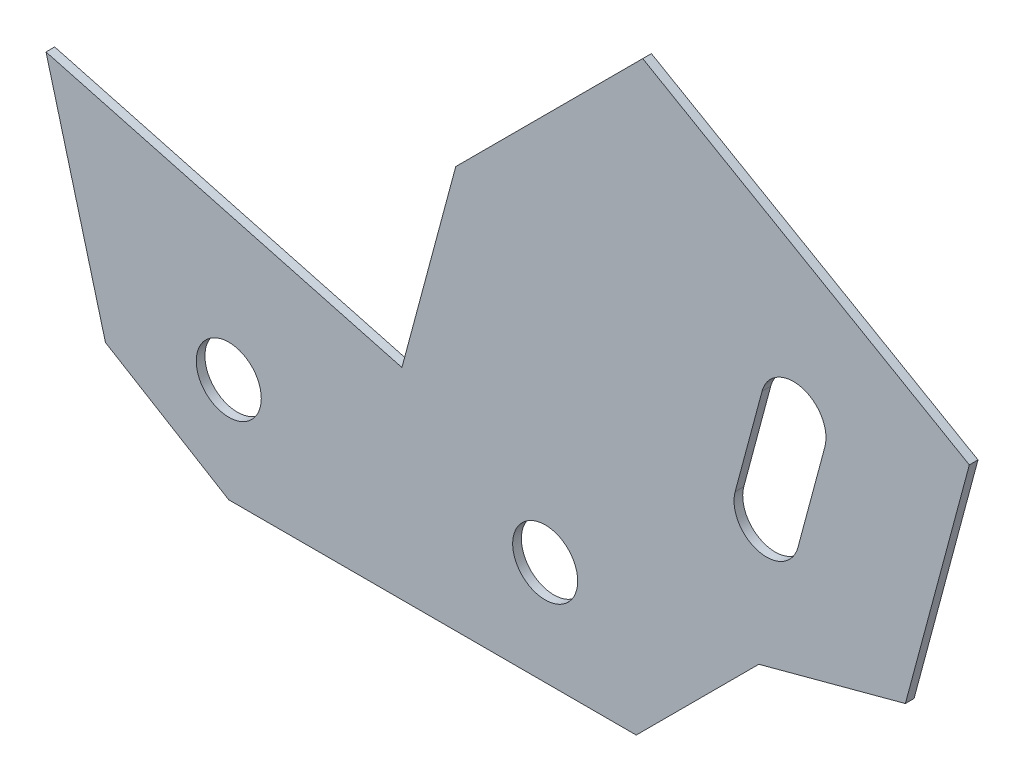
ISO-10303-21;
HEADER;
FILE_DESCRIPTION(('STEP AP214'),'2;1');
FILE_NAME('part.step','',(''),(''),'','','');
FILE_SCHEMA(('AUTOMOTIVE_DESIGN { 1 0 10303 214 1 1 1 1 }'));
ENDSEC;
DATA;
#1=APPLICATION_CONTEXT('core data for automotive mechanical design processes');
#2=APPLICATION_PROTOCOL_DEFINITION('international standard','automotive_design',2000,#1);
#3=PRODUCT_CONTEXT('',#1,'mechanical');
#4=PRODUCT('Part','Part','',(#3));
#5=PRODUCT_RELATED_PRODUCT_CATEGORY('part','',(#4));
#6=PRODUCT_DEFINITION_FORMATION('','',#4);
#7=PRODUCT_DEFINITION_CONTEXT('part definition',#1,'design');
#8=PRODUCT_DEFINITION('design','',#6,#7);
#9=PRODUCT_DEFINITION_SHAPE('','',#8);
#10=(LENGTH_UNIT() NAMED_UNIT(*) SI_UNIT(.MILLI.,.METRE.));
#11=(NAMED_UNIT(*) PLANE_ANGLE_UNIT() SI_UNIT($,.RADIAN.));
#12=(NAMED_UNIT(*) SI_UNIT($,.STERADIAN.) SOLID_ANGLE_UNIT());
#13=UNCERTAINTY_MEASURE_WITH_UNIT(LENGTH_MEASURE(1.E-05),#10,'distance_accuracy_value','');
#14=(GEOMETRIC_REPRESENTATION_CONTEXT(3) GLOBAL_UNCERTAINTY_ASSIGNED_CONTEXT((#13)) GLOBAL_UNIT_ASSIGNED_CONTEXT((#10,
#11,#12)) REPRESENTATION_CONTEXT('',''));
#15=CARTESIAN_POINT('',(0.,0.,0.));
#16=DIRECTION('',(0.,0.,1.));
#17=DIRECTION('',(1.,0.,0.));
#18=AXIS2_PLACEMENT_3D('',#15,#16,#17);
#19=CARTESIAN_POINT('',(0.,0.,2.));
#20=DIRECTION('',(0.,0.,1.));
#21=DIRECTION('',(1.,0.,0.));
#22=AXIS2_PLACEMENT_3D('',#19,#20,#21);
#23=PLANE('',#22);
#24=CARTESIAN_POINT('',(0.,0.,2.));
#25=DIRECTION('',(0.,0.,1.));
#26=DIRECTION('',(1.,0.,0.));
#27=AXIS2_PLACEMENT_3D('',#24,#25,#26);
#28=CIRCLE('',#27,7.5);
#29=CARTESIAN_POINT('',(7.5,0.,2.));
#30=VERTEX_POINT('',#29);
#31=EDGE_CURVE('E183',#30,#30,#28,.T.);
#32=ORIENTED_EDGE('',*,*,#31,.F.);
#33=EDGE_LOOP('',(#32));
#34=FACE_BOUND('',#33,.T.);
#35=DIRECTION('',(0.855595620228776,-0.517644795825608,0.));
#36=VECTOR('',#35,1.);
#37=CARTESIAN_POINT('',(-101.44296305226,-6.79169334933536,2.));
#38=LINE('',#37,#36);
#39=CARTESIAN_POINT('',(-101.44296305226,-6.79169334933536,2.));
#40=VERTEX_POINT('',#39);
#41=CARTESIAN_POINT('',(-73.,-24.,2.));
#42=VERTEX_POINT('',#41);
#43=EDGE_CURVE('E189',#40,#42,#38,.T.);
#44=ORIENTED_EDGE('',*,*,#43,.T.);
#45=DIRECTION('',(1.,0.,0.));
#46=VECTOR('',#45,1.);
#47=CARTESIAN_POINT('',(-73.,-24.,2.));
#48=LINE('',#47,#46);
#49=CARTESIAN_POINT('',(21.,-24.,2.));
#50=VERTEX_POINT('',#49);
#51=EDGE_CURVE('E192',#42,#50,#48,.T.);
#52=ORIENTED_EDGE('',*,*,#51,.T.);
#53=DIRECTION('',(0.707106781186546,0.707106781186549,0.));
#54=VECTOR('',#53,1.);
#55=CARTESIAN_POINT('',(21.,-24.,2.));
#56=LINE('',#55,#54);
#57=CARTESIAN_POINT('',(49.2842712474618,4.28427124746195,2.));
#58=VERTEX_POINT('',#57);
#59=EDGE_CURVE('E195',#50,#58,#56,.T.);
#60=ORIENTED_EDGE('',*,*,#59,.T.);
#61=DIRECTION('',(0.965925826289068,0.258819045102521,0.));
#62=VECTOR('',#61,1.);
#63=CARTESIAN_POINT('',(49.2842712474618,4.28427124746195,2.));
#64=LINE('',#63,#62);
#65=CARTESIAN_POINT('',(83.0916751675792,13.3429378260502,2.));
#66=VERTEX_POINT('',#65);
#67=EDGE_CURVE('E197',#58,#66,#64,.T.);
#68=ORIENTED_EDGE('',*,*,#67,.T.);
#69=DIRECTION('',(0.258819045102518,0.965925826289069,0.));
#70=VECTOR('',#69,1.);
#71=CARTESIAN_POINT('',(83.0916751675792,13.3429378260502,2.));
#72=LINE('',#71,#70);
#73=CARTESIAN_POINT('',(97.8443607384228,68.4007099245271,2.));
#74=VERTEX_POINT('',#73);
#75=EDGE_CURVE('E199',#66,#74,#72,.T.);
#76=ORIENTED_EDGE('',*,*,#75,.T.);
#77=DIRECTION('',(-0.866025403784442,0.499999999999995,0.));
#78=VECTOR('',#77,1.);
#79=CARTESIAN_POINT('',(97.8443607384228,68.4007099245271,2.));
#80=LINE('',#79,#78);
#81=CARTESIAN_POINT('',(22.5001506091763,111.900709924527,2.));
#82=VERTEX_POINT('',#81);
#83=EDGE_CURVE('E201',#74,#82,#80,.T.);
#84=ORIENTED_EDGE('',*,*,#83,.T.);
#85=DIRECTION('',(-0.707106781186541,-0.707106781186554,0.));
#86=VECTOR('',#85,1.);
#87=CARTESIAN_POINT('',(22.5001506091763,111.900709924527,2.));
#88=LINE('',#87,#86);
#89=CARTESIAN_POINT('',(-20.6333630432027,68.7671962721468,2.));
#90=VERTEX_POINT('',#89);
#91=EDGE_CURVE('E203',#82,#90,#88,.T.);
#92=ORIENTED_EDGE('',*,*,#91,.T.);
#93=DIRECTION('',(-0.25881904510251,-0.965925826289071,0.));
#94=VECTOR('',#93,1.);
#95=CARTESIAN_POINT('',(-20.6333630432027,68.7671962721468,2.));
#96=LINE('',#95,#94);
#97=CARTESIAN_POINT('',(-33.0566772081232,22.4027566102714,2.));
#98=VERTEX_POINT('',#97);
#99=EDGE_CURVE('E205',#90,#98,#96,.T.);
#100=ORIENTED_EDGE('',*,*,#99,.T.);
#101=DIRECTION('',(-0.96592582628907,0.258819045102513,0.));
#102=VECTOR('',#101,1.);
#103=CARTESIAN_POINT('',(-33.0566772081232,22.4027566102714,2.));
#104=LINE('',#103,#102);
#105=CARTESIAN_POINT('',(-115.160372442694,44.4023754439851,2.));
#106=VERTEX_POINT('',#105);
#107=EDGE_CURVE('E207',#98,#106,#104,.T.);
#108=ORIENTED_EDGE('',*,*,#107,.T.);
#109=DIRECTION('',(0.258819045102533,-0.965925826289065,0.));
#110=VECTOR('',#109,1.);
#111=CARTESIAN_POINT('',(-115.160372442694,44.4023754439851,2.));
#112=LINE('',#111,#110);
#113=EDGE_CURVE('E209',#106,#40,#112,.T.);
#114=ORIENTED_EDGE('',*,*,#113,.T.);
#115=EDGE_LOOP('',(#44,#52,#60,#68,#76,#84,#92,#100,#108,#114));
#116=FACE_BOUND('',#115,.T.);
#117=CARTESIAN_POINT('',(-73.,0.,2.));
#118=DIRECTION('',(0.,0.,1.));
#119=DIRECTION('',(1.,0.,0.));
#120=AXIS2_PLACEMENT_3D('',#117,#118,#119);
#121=CIRCLE('',#120,7.5);
#122=CARTESIAN_POINT('',(-65.5,0.,2.));
#123=VERTEX_POINT('',#122);
#124=EDGE_CURVE('E177',#123,#123,#121,.T.);
#125=ORIENTED_EDGE('',*,*,#124,.F.);
#126=EDGE_LOOP('',(#125));
#127=FACE_BOUND('',#126,.T.);
#128=DIRECTION('',(-0.258819045102525,-0.965925826289067,0.));
#129=VECTOR('',#128,1.);
#130=CARTESIAN_POINT('',(50.0312055789422,59.2167921143794,2.));
#131=LINE('',#130,#129);
#132=CARTESIAN_POINT('',(50.0312055789422,59.2167921143794,2.));
#133=VERTEX_POINT('',#132);
#134=CARTESIAN_POINT('',(43.8195484964816,36.0345722834418,2.));
#135=VERTEX_POINT('',#134);
#136=EDGE_CURVE('E149',#133,#135,#131,.T.);
#137=ORIENTED_EDGE('',*,*,#136,.F.);
#138=CARTESIAN_POINT('',(57.2756492761102,57.2756492761105,2.));
#139=DIRECTION('',(0.,0.,1.));
#140=DIRECTION('',(1.,0.,0.));
#141=AXIS2_PLACEMENT_3D('',#138,#139,#140);
#142=CIRCLE('',#141,7.5);
#143=CARTESIAN_POINT('',(64.5200929732782,55.3345064378415,2.));
#144=VERTEX_POINT('',#143);
#145=EDGE_CURVE('E141',#144,#133,#142,.T.);
#146=ORIENTED_EDGE('',*,*,#145,.F.);
#147=DIRECTION('',(0.258819045102524,0.965925826289067,0.));
#148=VECTOR('',#147,1.);
#149=CARTESIAN_POINT('',(64.5200929732782,55.3345064378415,2.));
#150=LINE('',#149,#148);
#151=CARTESIAN_POINT('',(58.3084358908176,32.1522866069039,2.));
#152=VERTEX_POINT('',#151);
#153=EDGE_CURVE('E163',#152,#144,#150,.T.);
#154=ORIENTED_EDGE('',*,*,#153,.F.);
#155=CARTESIAN_POINT('',(51.0639921936496,34.0934294451727,2.));
#156=DIRECTION('',(0.,0.,1.));
#157=DIRECTION('',(1.,0.,0.));
#158=AXIS2_PLACEMENT_3D('',#155,#156,#157);
#159=CIRCLE('',#158,7.50000000000001);
#160=EDGE_CURVE('E161',#135,#152,#159,.T.);
#161=ORIENTED_EDGE('',*,*,#160,.F.);
#162=EDGE_LOOP('',(#137,#146,#154,#161));
#163=FACE_BOUND('',#162,.T.);
#164=ADVANCED_FACE('F40',(#34,#116,#127,#163),#23,.T.);
#165=CARTESIAN_POINT('',(0.,0.,0.));
#166=DIRECTION('',(0.,0.,1.));
#167=DIRECTION('',(1.,0.,0.));
#168=AXIS2_PLACEMENT_3D('',#165,#166,#167);
#169=PLANE('',#168);
#170=CARTESIAN_POINT('',(-73.,0.,0.));
#171=DIRECTION('',(0.,0.,1.));
#172=DIRECTION('',(1.,0.,0.));
#173=AXIS2_PLACEMENT_3D('',#170,#171,#172);
#174=CIRCLE('',#173,7.5);
#175=CARTESIAN_POINT('',(-65.5,0.,0.));
#176=VERTEX_POINT('',#175);
#177=EDGE_CURVE('E157',#176,#176,#174,.T.);
#178=ORIENTED_EDGE('',*,*,#177,.T.);
#179=EDGE_LOOP('',(#178));
#180=FACE_BOUND('',#179,.T.);
#181=CARTESIAN_POINT('',(0.,0.,0.));
#182=DIRECTION('',(0.,0.,1.));
#183=DIRECTION('',(1.,0.,0.));
#184=AXIS2_PLACEMENT_3D('',#181,#182,#183);
#185=CIRCLE('',#184,7.5);
#186=CARTESIAN_POINT('',(7.5,0.,0.));
#187=VERTEX_POINT('',#186);
#188=EDGE_CURVE('E180',#187,#187,#185,.T.);
#189=ORIENTED_EDGE('',*,*,#188,.T.);
#190=EDGE_LOOP('',(#189));
#191=FACE_BOUND('',#190,.T.);
#192=DIRECTION('',(0.855595620228776,-0.517644795825608,0.));
#193=VECTOR('',#192,1.);
#194=CARTESIAN_POINT('',(-101.44296305226,-6.79169334933536,0.));
#195=LINE('',#194,#193);
#196=CARTESIAN_POINT('',(-101.44296305226,-6.79169334933536,0.));
#197=VERTEX_POINT('',#196);
#198=CARTESIAN_POINT('',(-73.,-24.,0.));
#199=VERTEX_POINT('',#198);
#200=EDGE_CURVE('E186',#197,#199,#195,.T.);
#201=ORIENTED_EDGE('',*,*,#200,.F.);
#202=DIRECTION('',(0.258819045102533,-0.965925826289065,0.));
#203=VECTOR('',#202,1.);
#204=CARTESIAN_POINT('',(-115.160372442694,44.4023754439851,0.));
#205=LINE('',#204,#203);
#206=CARTESIAN_POINT('',(-115.160372442694,44.4023754439851,0.));
#207=VERTEX_POINT('',#206);
#208=EDGE_CURVE('E193',#207,#197,#205,.T.);
#209=ORIENTED_EDGE('',*,*,#208,.F.);
#210=DIRECTION('',(-0.96592582628907,0.258819045102513,0.));
#211=VECTOR('',#210,1.);
#212=CARTESIAN_POINT('',(-33.0566772081232,22.4027566102714,0.));
#213=LINE('',#212,#211);
#214=CARTESIAN_POINT('',(-33.0566772081232,22.4027566102714,0.));
#215=VERTEX_POINT('',#214);
#216=EDGE_CURVE('E228',#215,#207,#213,.T.);
#217=ORIENTED_EDGE('',*,*,#216,.F.);
#218=DIRECTION('',(-0.25881904510251,-0.965925826289071,0.));
#219=VECTOR('',#218,1.);
#220=CARTESIAN_POINT('',(-20.6333630432027,68.7671962721468,0.));
#221=LINE('',#220,#219);
#222=CARTESIAN_POINT('',(-20.6333630432027,68.7671962721468,0.));
#223=VERTEX_POINT('',#222);
#224=EDGE_CURVE('E226',#223,#215,#221,.T.);
#225=ORIENTED_EDGE('',*,*,#224,.F.);
#226=DIRECTION('',(-0.707106781186541,-0.707106781186554,0.));
#227=VECTOR('',#226,1.);
#228=CARTESIAN_POINT('',(22.5001506091763,111.900709924527,0.));
#229=LINE('',#228,#227);
#230=CARTESIAN_POINT('',(22.5001506091763,111.900709924527,0.));
#231=VERTEX_POINT('',#230);
#232=EDGE_CURVE('E224',#231,#223,#229,.T.);
#233=ORIENTED_EDGE('',*,*,#232,.F.);
#234=DIRECTION('',(-0.866025403784442,0.499999999999995,0.));
#235=VECTOR('',#234,1.);
#236=CARTESIAN_POINT('',(97.8443607384228,68.4007099245271,0.));
#237=LINE('',#236,#235);
#238=CARTESIAN_POINT('',(97.8443607384228,68.4007099245271,0.));
#239=VERTEX_POINT('',#238);
#240=EDGE_CURVE('E222',#239,#231,#237,.T.);
#241=ORIENTED_EDGE('',*,*,#240,.F.);
#242=DIRECTION('',(0.258819045102518,0.965925826289069,0.));
#243=VECTOR('',#242,1.);
#244=CARTESIAN_POINT('',(83.0916751675792,13.3429378260502,0.));
#245=LINE('',#244,#243);
#246=CARTESIAN_POINT('',(83.0916751675792,13.3429378260502,0.));
#247=VERTEX_POINT('',#246);
#248=EDGE_CURVE('E220',#247,#239,#245,.T.);
#249=ORIENTED_EDGE('',*,*,#248,.F.);
#250=DIRECTION('',(0.965925826289068,0.258819045102521,0.));
#251=VECTOR('',#250,1.);
#252=CARTESIAN_POINT('',(49.2842712474618,4.28427124746195,0.));
#253=LINE('',#252,#251);
#254=CARTESIAN_POINT('',(49.2842712474618,4.28427124746195,0.));
#255=VERTEX_POINT('',#254);
#256=EDGE_CURVE('E218',#255,#247,#253,.T.);
#257=ORIENTED_EDGE('',*,*,#256,.F.);
#258=DIRECTION('',(0.707106781186546,0.707106781186549,0.));
#259=VECTOR('',#258,1.);
#260=CARTESIAN_POINT('',(21.,-24.,0.));
#261=LINE('',#260,#259);
#262=CARTESIAN_POINT('',(21.,-24.,0.));
#263=VERTEX_POINT('',#262);
#264=EDGE_CURVE('E216',#263,#255,#261,.T.);
#265=ORIENTED_EDGE('',*,*,#264,.F.);
#266=DIRECTION('',(1.,0.,0.));
#267=VECTOR('',#266,1.);
#268=CARTESIAN_POINT('',(-73.,-24.,0.));
#269=LINE('',#268,#267);
#270=EDGE_CURVE('E214',#199,#263,#269,.T.);
#271=ORIENTED_EDGE('',*,*,#270,.F.);
#272=EDGE_LOOP('',(#201,#209,#217,#225,#233,#241,#249,#257,#265,#271));
#273=FACE_BOUND('',#272,.T.);
#274=CARTESIAN_POINT('',(57.2756492761102,57.2756492761105,0.));
#275=DIRECTION('',(0.,0.,1.));
#276=DIRECTION('',(1.,0.,0.));
#277=AXIS2_PLACEMENT_3D('',#274,#275,#276);
#278=CIRCLE('',#277,7.5);
#279=CARTESIAN_POINT('',(64.5200929732782,55.3345064378415,0.));
#280=VERTEX_POINT('',#279);
#281=CARTESIAN_POINT('',(50.0312055789422,59.2167921143794,0.));
#282=VERTEX_POINT('',#281);
#283=EDGE_CURVE('E63',#280,#282,#278,.T.);
#284=ORIENTED_EDGE('',*,*,#283,.T.);
#285=DIRECTION('',(-0.258819045102525,-0.965925826289067,0.));
#286=VECTOR('',#285,1.);
#287=CARTESIAN_POINT('',(50.0312055789422,59.2167921143794,0.));
#288=LINE('',#287,#286);
#289=CARTESIAN_POINT('',(43.8195484964816,36.0345722834418,0.));
#290=VERTEX_POINT('',#289);
#291=EDGE_CURVE('E156',#282,#290,#288,.T.);
#292=ORIENTED_EDGE('',*,*,#291,.T.);
#293=CARTESIAN_POINT('',(51.0639921936496,34.0934294451727,0.));
#294=DIRECTION('',(0.,0.,1.));
#295=DIRECTION('',(1.,0.,0.));
#296=AXIS2_PLACEMENT_3D('',#293,#294,#295);
#297=CIRCLE('',#296,7.50000000000001);
#298=CARTESIAN_POINT('',(58.3084358908176,32.1522866069039,0.));
#299=VERTEX_POINT('',#298);
#300=EDGE_CURVE('E169',#290,#299,#297,.T.);
#301=ORIENTED_EDGE('',*,*,#300,.T.);
#302=DIRECTION('',(0.258819045102524,0.965925826289067,0.));
#303=VECTOR('',#302,1.);
#304=CARTESIAN_POINT('',(64.5200929732782,55.3345064378415,0.));
#305=LINE('',#304,#303);
#306=EDGE_CURVE('E150',#299,#280,#305,.T.);
#307=ORIENTED_EDGE('',*,*,#306,.T.);
#308=EDGE_LOOP('',(#284,#292,#301,#307));
#309=FACE_BOUND('',#308,.T.);
#310=ADVANCED_FACE('F264',(#180,#191,#273,#309),#169,.F.);
#311=CARTESIAN_POINT('',(-101.44296305226,-6.79169334933536,2.));
#312=DIRECTION('',(0.517644795825608,0.855595620228776,0.));
#313=DIRECTION('',(-0.855595620228776,0.517644795825608,0.));
#314=AXIS2_PLACEMENT_3D('',#311,#312,#313);
#315=PLANE('',#314);
#316=ORIENTED_EDGE('',*,*,#200,.T.);
#317=DIRECTION('',(0.,0.,-1.));
#318=VECTOR('',#317,1.);
#319=CARTESIAN_POINT('',(-73.,-24.,2.));
#320=LINE('',#319,#318);
#321=EDGE_CURVE('E11',#42,#199,#320,.T.);
#322=ORIENTED_EDGE('',*,*,#321,.F.);
#323=ORIENTED_EDGE('',*,*,#43,.F.);
#324=DIRECTION('',(0.,0.,-1.));
#325=VECTOR('',#324,1.);
#326=CARTESIAN_POINT('',(-101.44296305226,-6.79169334933536,2.));
#327=LINE('',#326,#325);
#328=EDGE_CURVE('E211',#40,#197,#327,.T.);
#329=ORIENTED_EDGE('',*,*,#328,.T.);
#330=EDGE_LOOP('',(#316,#322,#323,#329));
#331=FACE_BOUND('',#330,.T.);
#332=ADVANCED_FACE('F42',(#331),#315,.F.);
#333=CARTESIAN_POINT('',(-73.,-24.,2.));
#334=DIRECTION('',(0.,1.,0.));
#335=DIRECTION('',(0.,0.,1.));
#336=AXIS2_PLACEMENT_3D('',#333,#334,#335);
#337=PLANE('',#336);
#338=ORIENTED_EDGE('',*,*,#270,.T.);
#339=DIRECTION('',(0.,0.,-1.));
#340=VECTOR('',#339,1.);
#341=CARTESIAN_POINT('',(21.,-24.,2.));
#342=LINE('',#341,#340);
#343=EDGE_CURVE('E48',#50,#263,#342,.T.);
#344=ORIENTED_EDGE('',*,*,#343,.F.);
#345=ORIENTED_EDGE('',*,*,#51,.F.);
#346=ORIENTED_EDGE('',*,*,#321,.T.);
#347=EDGE_LOOP('',(#338,#344,#345,#346));
#348=FACE_BOUND('',#347,.T.);
#349=ADVANCED_FACE('F282',(#348),#337,.F.);
#350=CARTESIAN_POINT('',(21.,-24.,2.));
#351=DIRECTION('',(-0.707106781186549,0.707106781186546,0.));
#352=DIRECTION('',(-0.707106781186546,-0.707106781186549,0.));
#353=AXIS2_PLACEMENT_3D('',#350,#351,#352);
#354=PLANE('',#353);
#355=ORIENTED_EDGE('',*,*,#264,.T.);
#356=DIRECTION('',(0.,0.,-1.));
#357=VECTOR('',#356,1.);
#358=CARTESIAN_POINT('',(49.2842712474618,4.28427124746195,2.));
#359=LINE('',#358,#357);
#360=EDGE_CURVE('E251',#58,#255,#359,.T.);
#361=ORIENTED_EDGE('',*,*,#360,.F.);
#362=ORIENTED_EDGE('',*,*,#59,.F.);
#363=ORIENTED_EDGE('',*,*,#343,.T.);
#364=EDGE_LOOP('',(#355,#361,#362,#363));
#365=FACE_BOUND('',#364,.T.);
#366=ADVANCED_FACE('F258',(#365),#354,.F.);
#367=CARTESIAN_POINT('',(49.2842712474618,4.28427124746195,2.));
#368=DIRECTION('',(-0.258819045102521,0.965925826289068,0.));
#369=DIRECTION('',(-0.965925826289068,-0.258819045102521,0.));
#370=AXIS2_PLACEMENT_3D('',#367,#368,#369);
#371=PLANE('',#370);
#372=ORIENTED_EDGE('',*,*,#256,.T.);
#373=DIRECTION('',(0.,0.,-1.));
#374=VECTOR('',#373,1.);
#375=CARTESIAN_POINT('',(83.0916751675792,13.3429378260502,2.));
#376=LINE('',#375,#374);
#377=EDGE_CURVE('E248',#66,#247,#376,.T.);
#378=ORIENTED_EDGE('',*,*,#377,.F.);
#379=ORIENTED_EDGE('',*,*,#67,.F.);
#380=ORIENTED_EDGE('',*,*,#360,.T.);
#381=EDGE_LOOP('',(#372,#378,#379,#380));
#382=FACE_BOUND('',#381,.T.);
#383=ADVANCED_FACE('F270',(#382),#371,.F.);
#384=CARTESIAN_POINT('',(83.0916751675792,13.3429378260502,2.));
#385=DIRECTION('',(-0.965925826289069,0.258819045102518,0.));
#386=DIRECTION('',(-0.258819045102518,-0.965925826289069,0.));
#387=AXIS2_PLACEMENT_3D('',#384,#385,#386);
#388=PLANE('',#387);
#389=ORIENTED_EDGE('',*,*,#248,.T.);
#390=DIRECTION('',(0.,0.,-1.));
#391=VECTOR('',#390,1.);
#392=CARTESIAN_POINT('',(97.8443607384228,68.4007099245271,2.));
#393=LINE('',#392,#391);
#394=EDGE_CURVE('E245',#74,#239,#393,.T.);
#395=ORIENTED_EDGE('',*,*,#394,.F.);
#396=ORIENTED_EDGE('',*,*,#75,.F.);
#397=ORIENTED_EDGE('',*,*,#377,.T.);
#398=EDGE_LOOP('',(#389,#395,#396,#397));
#399=FACE_BOUND('',#398,.T.);
#400=ADVANCED_FACE('F274',(#399),#388,.F.);
#401=CARTESIAN_POINT('',(97.8443607384228,68.4007099245271,2.));
#402=DIRECTION('',(-0.499999999999995,-0.866025403784442,0.));
#403=DIRECTION('',(0.866025403784442,-0.499999999999995,0.));
#404=AXIS2_PLACEMENT_3D('',#401,#402,#403);
#405=PLANE('',#404);
#406=ORIENTED_EDGE('',*,*,#240,.T.);
#407=DIRECTION('',(0.,0.,-1.));
#408=VECTOR('',#407,1.);
#409=CARTESIAN_POINT('',(22.5001506091763,111.900709924527,2.));
#410=LINE('',#409,#408);
#411=EDGE_CURVE('E242',#82,#231,#410,.T.);
#412=ORIENTED_EDGE('',*,*,#411,.F.);
#413=ORIENTED_EDGE('',*,*,#83,.F.);
#414=ORIENTED_EDGE('',*,*,#394,.T.);
#415=EDGE_LOOP('',(#406,#412,#413,#414));
#416=FACE_BOUND('',#415,.T.);
#417=ADVANCED_FACE('F305',(#416),#405,.F.);
#418=CARTESIAN_POINT('',(22.5001506091763,111.900709924527,2.));
#419=DIRECTION('',(0.707106781186554,-0.707106781186541,0.));
#420=DIRECTION('',(0.707106781186541,0.707106781186554,0.));
#421=AXIS2_PLACEMENT_3D('',#418,#419,#420);
#422=PLANE('',#421);
#423=ORIENTED_EDGE('',*,*,#232,.T.);
#424=DIRECTION('',(0.,0.,-1.));
#425=VECTOR('',#424,1.);
#426=CARTESIAN_POINT('',(-20.6333630432027,68.7671962721468,2.));
#427=LINE('',#426,#425);
#428=EDGE_CURVE('E239',#90,#223,#427,.T.);
#429=ORIENTED_EDGE('',*,*,#428,.F.);
#430=ORIENTED_EDGE('',*,*,#91,.F.);
#431=ORIENTED_EDGE('',*,*,#411,.T.);
#432=EDGE_LOOP('',(#423,#429,#430,#431));
#433=FACE_BOUND('',#432,.T.);
#434=ADVANCED_FACE('F302',(#433),#422,.F.);
#435=CARTESIAN_POINT('',(-20.6333630432027,68.7671962721468,2.));
#436=DIRECTION('',(0.965925826289071,-0.25881904510251,0.));
#437=DIRECTION('',(0.25881904510251,0.965925826289071,0.));
#438=AXIS2_PLACEMENT_3D('',#435,#436,#437);
#439=PLANE('',#438);
#440=ORIENTED_EDGE('',*,*,#224,.T.);
#441=DIRECTION('',(0.,0.,-1.));
#442=VECTOR('',#441,1.);
#443=CARTESIAN_POINT('',(-33.0566772081232,22.4027566102714,2.));
#444=LINE('',#443,#442);
#445=EDGE_CURVE('E236',#98,#215,#444,.T.);
#446=ORIENTED_EDGE('',*,*,#445,.F.);
#447=ORIENTED_EDGE('',*,*,#99,.F.);
#448=ORIENTED_EDGE('',*,*,#428,.T.);
#449=EDGE_LOOP('',(#440,#446,#447,#448));
#450=FACE_BOUND('',#449,.T.);
#451=ADVANCED_FACE('F298',(#450),#439,.F.);
#452=CARTESIAN_POINT('',(-33.0566772081232,22.4027566102714,2.));
#453=DIRECTION('',(-0.258819045102514,-0.96592582628907,0.));
#454=DIRECTION('',(0.96592582628907,-0.258819045102514,0.));
#455=AXIS2_PLACEMENT_3D('',#452,#453,#454);
#456=PLANE('',#455);
#457=ORIENTED_EDGE('',*,*,#216,.T.);
#458=DIRECTION('',(0.,0.,-1.));
#459=VECTOR('',#458,1.);
#460=CARTESIAN_POINT('',(-115.160372442694,44.4023754439851,2.));
#461=LINE('',#460,#459);
#462=EDGE_CURVE('E233',#106,#207,#461,.T.);
#463=ORIENTED_EDGE('',*,*,#462,.F.);
#464=ORIENTED_EDGE('',*,*,#107,.F.);
#465=ORIENTED_EDGE('',*,*,#445,.T.);
#466=EDGE_LOOP('',(#457,#463,#464,#465));
#467=FACE_BOUND('',#466,.T.);
#468=ADVANCED_FACE('F294',(#467),#456,.F.);
#469=CARTESIAN_POINT('',(-115.160372442694,44.4023754439851,2.));
#470=DIRECTION('',(0.965925826289065,0.258819045102533,0.));
#471=DIRECTION('',(-0.258819045102533,0.965925826289065,0.));
#472=AXIS2_PLACEMENT_3D('',#469,#470,#471);
#473=PLANE('',#472);
#474=ORIENTED_EDGE('',*,*,#208,.T.);
#475=ORIENTED_EDGE('',*,*,#328,.F.);
#476=ORIENTED_EDGE('',*,*,#113,.F.);
#477=ORIENTED_EDGE('',*,*,#462,.T.);
#478=EDGE_LOOP('',(#474,#475,#476,#477));
#479=FACE_BOUND('',#478,.T.);
#480=ADVANCED_FACE('F289',(#479),#473,.F.);
#481=CARTESIAN_POINT('',(0.,0.,2.));
#482=DIRECTION('',(0.,0.,-1.));
#483=DIRECTION('',(-1.,0.,0.));
#484=AXIS2_PLACEMENT_3D('',#481,#482,#483);
#485=CYLINDRICAL_SURFACE('',#484,7.5);
#486=ORIENTED_EDGE('',*,*,#31,.T.);
#487=EDGE_LOOP('',(#486));
#488=FACE_BOUND('',#487,.T.);
#489=ORIENTED_EDGE('',*,*,#188,.F.);
#490=EDGE_LOOP('',(#489));
#491=FACE_BOUND('',#490,.T.);
#492=ADVANCED_FACE('F324',(#488,#491),#485,.F.);
#493=CARTESIAN_POINT('',(-73.,0.,2.));
#494=DIRECTION('',(0.,0.,-1.));
#495=DIRECTION('',(-1.,0.,0.));
#496=AXIS2_PLACEMENT_3D('',#493,#494,#495);
#497=CYLINDRICAL_SURFACE('',#496,7.5);
#498=ORIENTED_EDGE('',*,*,#124,.T.);
#499=EDGE_LOOP('',(#498));
#500=FACE_BOUND('',#499,.T.);
#501=ORIENTED_EDGE('',*,*,#177,.F.);
#502=EDGE_LOOP('',(#501));
#503=FACE_BOUND('',#502,.T.);
#504=ADVANCED_FACE('F350',(#500,#503),#497,.F.);
#505=CARTESIAN_POINT('',(57.2756492761102,57.2756492761105,2.));
#506=DIRECTION('',(0.,0.,-1.));
#507=DIRECTION('',(-1.,0.,0.));
#508=AXIS2_PLACEMENT_3D('',#505,#506,#507);
#509=CYLINDRICAL_SURFACE('',#508,7.5);
#510=ORIENTED_EDGE('',*,*,#283,.F.);
#511=DIRECTION('',(0.,0.,-1.));
#512=VECTOR('',#511,1.);
#513=CARTESIAN_POINT('',(64.5200929732782,55.3345064378415,2.));
#514=LINE('',#513,#512);
#515=EDGE_CURVE('E145',#144,#280,#514,.T.);
#516=ORIENTED_EDGE('',*,*,#515,.F.);
#517=ORIENTED_EDGE('',*,*,#145,.T.);
#518=DIRECTION('',(0.,0.,-1.));
#519=VECTOR('',#518,1.);
#520=CARTESIAN_POINT('',(50.0312055789422,59.2167921143794,2.));
#521=LINE('',#520,#519);
#522=EDGE_CURVE('E144',#133,#282,#521,.T.);
#523=ORIENTED_EDGE('',*,*,#522,.T.);
#524=EDGE_LOOP('',(#510,#516,#517,#523));
#525=FACE_BOUND('',#524,.T.);
#526=ADVANCED_FACE('F143',(#525),#509,.F.);
#527=CARTESIAN_POINT('',(50.0312055789422,59.2167921143794,2.));
#528=DIRECTION('',(0.965925826289067,-0.258819045102525,0.));
#529=DIRECTION('',(0.258819045102525,0.965925826289067,0.));
#530=AXIS2_PLACEMENT_3D('',#527,#528,#529);
#531=PLANE('',#530);
#532=ORIENTED_EDGE('',*,*,#291,.F.);
#533=ORIENTED_EDGE('',*,*,#522,.F.);
#534=ORIENTED_EDGE('',*,*,#136,.T.);
#535=DIRECTION('',(0.,0.,-1.));
#536=VECTOR('',#535,1.);
#537=CARTESIAN_POINT('',(43.8195484964816,36.0345722834418,2.));
#538=LINE('',#537,#536);
#539=EDGE_CURVE('E158',#135,#290,#538,.T.);
#540=ORIENTED_EDGE('',*,*,#539,.T.);
#541=EDGE_LOOP('',(#532,#533,#534,#540));
#542=FACE_BOUND('',#541,.T.);
#543=ADVANCED_FACE('F153',(#542),#531,.T.);
#544=CARTESIAN_POINT('',(51.0639921936496,34.0934294451727,2.));
#545=DIRECTION('',(0.,0.,-1.));
#546=DIRECTION('',(-1.,0.,0.));
#547=AXIS2_PLACEMENT_3D('',#544,#545,#546);
#548=CYLINDRICAL_SURFACE('',#547,7.50000000000001);
#549=ORIENTED_EDGE('',*,*,#300,.F.);
#550=ORIENTED_EDGE('',*,*,#539,.F.);
#551=ORIENTED_EDGE('',*,*,#160,.T.);
#552=DIRECTION('',(0.,0.,-1.));
#553=VECTOR('',#552,1.);
#554=CARTESIAN_POINT('',(58.3084358908176,32.1522866069039,2.));
#555=LINE('',#554,#553);
#556=EDGE_CURVE('E55',#152,#299,#555,.T.);
#557=ORIENTED_EDGE('',*,*,#556,.T.);
#558=EDGE_LOOP('',(#549,#550,#551,#557));
#559=FACE_BOUND('',#558,.T.);
#560=ADVANCED_FACE('F369',(#559),#548,.F.);
#561=CARTESIAN_POINT('',(64.5200929732782,55.3345064378415,2.));
#562=DIRECTION('',(-0.965925826289068,0.258819045102524,0.));
#563=DIRECTION('',(-0.258819045102524,-0.965925826289068,0.));
#564=AXIS2_PLACEMENT_3D('',#561,#562,#563);
#565=PLANE('',#564);
#566=ORIENTED_EDGE('',*,*,#306,.F.);
#567=ORIENTED_EDGE('',*,*,#556,.F.);
#568=ORIENTED_EDGE('',*,*,#153,.T.);
#569=ORIENTED_EDGE('',*,*,#515,.T.);
#570=EDGE_LOOP('',(#566,#567,#568,#569));
#571=FACE_BOUND('',#570,.T.);
#572=ADVANCED_FACE('F376',(#571),#565,.T.);
#573=CLOSED_SHELL('',(#164,#310,#332,#349,#366,#383,#400,#417,#434,#451,#468,#480,#492,#504,
#526,#543,#560,#572));
#574=MANIFOLD_SOLID_BREP('B2',#573);
#575=ADVANCED_BREP_SHAPE_REPRESENTATION('',(#18,#574),#14);
#576=SHAPE_DEFINITION_REPRESENTATION(#9,#575);
ENDSEC;
END-ISO-10303-21;
